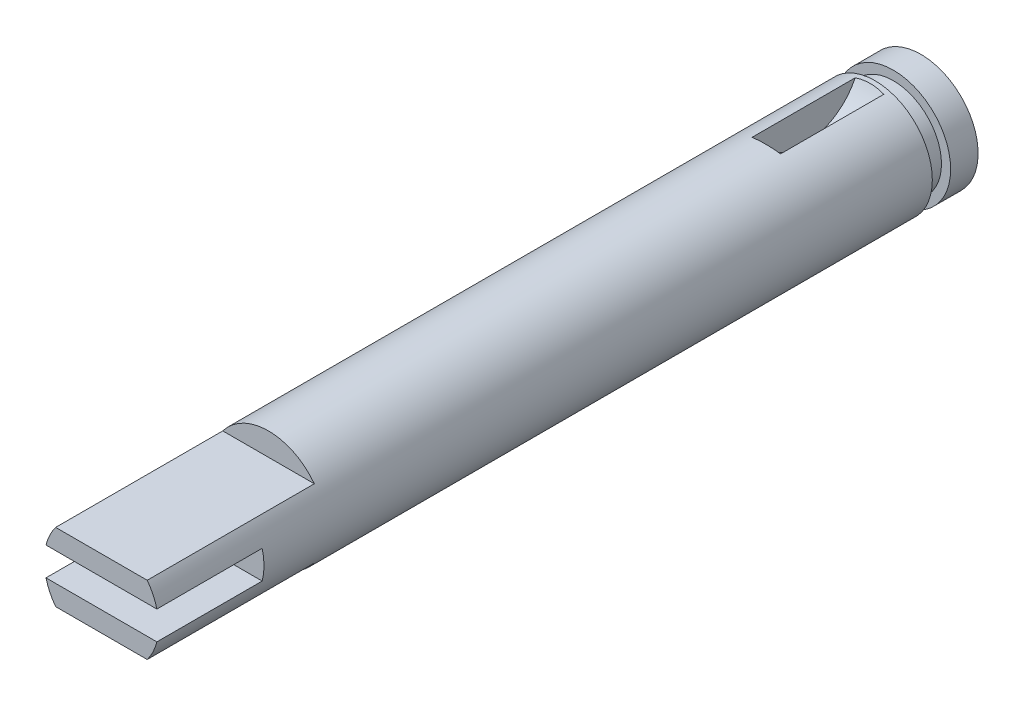
ISO-10303-21;
HEADER;
FILE_DESCRIPTION(('STEP AP214'),'2;1');
FILE_NAME('part.step','',(''),(''),'','','');
FILE_SCHEMA(('AUTOMOTIVE_DESIGN { 1 0 10303 214 1 1 1 1 }'));
ENDSEC;
DATA;
#1=APPLICATION_CONTEXT('core data for automotive mechanical design processes');
#2=APPLICATION_PROTOCOL_DEFINITION('international standard','automotive_design',2000,#1);
#3=PRODUCT_CONTEXT('',#1,'mechanical');
#4=PRODUCT('Part','Part','',(#3));
#5=PRODUCT_RELATED_PRODUCT_CATEGORY('part','',(#4));
#6=PRODUCT_DEFINITION_FORMATION('','',#4);
#7=PRODUCT_DEFINITION_CONTEXT('part definition',#1,'design');
#8=PRODUCT_DEFINITION('design','',#6,#7);
#9=PRODUCT_DEFINITION_SHAPE('','',#8);
#10=(LENGTH_UNIT() NAMED_UNIT(*) SI_UNIT(.MILLI.,.METRE.));
#11=(NAMED_UNIT(*) PLANE_ANGLE_UNIT() SI_UNIT($,.RADIAN.));
#12=(NAMED_UNIT(*) SI_UNIT($,.STERADIAN.) SOLID_ANGLE_UNIT());
#13=UNCERTAINTY_MEASURE_WITH_UNIT(LENGTH_MEASURE(1.E-05),#10,'distance_accuracy_value','');
#14=(GEOMETRIC_REPRESENTATION_CONTEXT(3) GLOBAL_UNCERTAINTY_ASSIGNED_CONTEXT((#13)) GLOBAL_UNIT_ASSIGNED_CONTEXT((#10,
#11,#12)) REPRESENTATION_CONTEXT('',''));
#15=CARTESIAN_POINT('',(0.,0.,0.));
#16=DIRECTION('',(0.,0.,1.));
#17=DIRECTION('',(1.,0.,0.));
#18=AXIS2_PLACEMENT_3D('',#15,#16,#17);
#19=CARTESIAN_POINT('',(0.,0.,42.926));
#20=DIRECTION('',(0.,0.,1.));
#21=DIRECTION('',(1.,0.,0.));
#22=AXIS2_PLACEMENT_3D('',#19,#20,#21);
#23=PLANE('',#22);
#24=CARTESIAN_POINT('',(0.,0.,42.926));
#25=DIRECTION('',(0.,0.,1.));
#26=DIRECTION('',(1.,0.,0.));
#27=AXIS2_PLACEMENT_3D('',#24,#25,#26);
#28=CIRCLE('',#27,3.175);
#29=CARTESIAN_POINT('',(-3.07581310225443,-0.7874,42.926));
#30=VERTEX_POINT('',#29);
#31=CARTESIAN_POINT('',(-2.54,-1.905,42.926));
#32=VERTEX_POINT('',#31);
#33=EDGE_CURVE('E198',#30,#32,#28,.T.);
#34=ORIENTED_EDGE('',*,*,#33,.T.);
#35=DIRECTION('',(1.,0.,0.));
#36=VECTOR('',#35,1.);
#37=CARTESIAN_POINT('',(-3.175,-1.905,42.926));
#38=LINE('',#37,#36);
#39=CARTESIAN_POINT('',(2.54,-1.905,42.926));
#40=VERTEX_POINT('',#39);
#41=EDGE_CURVE('E149',#32,#40,#38,.T.);
#42=ORIENTED_EDGE('',*,*,#41,.T.);
#43=CARTESIAN_POINT('',(3.07581310225443,-0.7874,42.926));
#44=VERTEX_POINT('',#43);
#45=EDGE_CURVE('E64',#40,#44,#28,.T.);
#46=ORIENTED_EDGE('',*,*,#45,.T.);
#47=DIRECTION('',(1.,0.,0.));
#48=VECTOR('',#47,1.);
#49=CARTESIAN_POINT('',(-3.175,-0.7874,42.926));
#50=LINE('',#49,#48);
#51=EDGE_CURVE('E161',#30,#44,#50,.T.);
#52=ORIENTED_EDGE('',*,*,#51,.F.);
#53=EDGE_LOOP('',(#34,#42,#46,#52));
#54=FACE_BOUND('',#53,.T.);
#55=ADVANCED_FACE('F39',(#54),#23,.T.);
#56=CARTESIAN_POINT('',(0.,0.,42.926));
#57=DIRECTION('',(0.,0.,-1.));
#58=DIRECTION('',(-1.,0.,0.));
#59=AXIS2_PLACEMENT_3D('',#56,#57,#58);
#60=CYLINDRICAL_SURFACE('',#59,3.175);
#61=CARTESIAN_POINT('',(0.,0.,0.));
#62=DIRECTION('',(0.,0.,1.));
#63=DIRECTION('',(1.,0.,0.));
#64=AXIS2_PLACEMENT_3D('',#61,#62,#63);
#65=CIRCLE('',#64,3.175);
#66=CARTESIAN_POINT('',(3.175,0.,0.));
#67=VERTEX_POINT('',#66);
#68=EDGE_CURVE('E183',#67,#67,#65,.T.);
#69=ORIENTED_EDGE('',*,*,#68,.T.);
#70=EDGE_LOOP('',(#69));
#71=FACE_BOUND('',#70,.T.);
#72=CARTESIAN_POINT('',(0.79375,3.07418053105214,0.31117755725787));
#73=CARTESIAN_POINT('',(0.714888608920865,3.09455662843597,0.301450554495417));
#74=CARTESIAN_POINT('',(0.63505416141262,3.11191895979803,0.293381371889491));
#75=CARTESIAN_POINT('',(0.474031104442736,3.14047497122854,0.280327929345211));
#76=CARTESIAN_POINT('',(0.392842353277951,3.15166800156809,0.275343994327388));
#77=CARTESIAN_POINT('',(0.231571379542788,3.16755748116306,0.268313017791284));
#78=CARTESIAN_POINT('',(0.151505888276026,3.17239566707134,0.266201862514545));
#79=CARTESIAN_POINT('',(-0.00875508518506204,3.17599957954489,0.264627640077035));
#80=CARTESIAN_POINT('',(-0.0889505252156203,3.17476698826052,0.265163839361458));
#81=CARTESIAN_POINT('',(-0.273819967836502,3.16491035844165,0.269480487372106));
#82=CARTESIAN_POINT('',(-0.378370536384788,3.1541121097031,0.274215701820489));
#83=CARTESIAN_POINT('',(-0.534502897532229,3.13013870504281,0.285045446695591));
#84=CARTESIAN_POINT('',(-0.586827990033408,3.12074930541512,0.289323834308464));
#85=CARTESIAN_POINT('',(-0.690818751526154,3.09938886056079,0.299223415951192));
#86=CARTESIAN_POINT('',(-0.742484433325476,3.08741786555765,0.304844583858243));
#87=CARTESIAN_POINT('',(-0.79375,3.07418053105214,0.31117755725787));
#88=B_SPLINE_CURVE_WITH_KNOTS('',3,(#72,#73,#74,#75,#76,#77,#78,#79,#80,#81,#82,#83,#84,#85,#86,
#87),.UNSPECIFIED.,.F.,.F.,(4,2,2,2,2,2,2,4),(0.,0.245998689057966,0.492023280877516,
0.732461803114019,0.972833706040775,1.28776854451322,1.44769609311939,1.60762053070593),.UNSPECIFIED.);
#89=CARTESIAN_POINT('',(0.79375,3.07418053105214,0.31117755725787));
#90=VERTEX_POINT('',#89);
#91=CARTESIAN_POINT('',(-0.79375,3.07418053105214,0.31117755725787));
#92=VERTEX_POINT('',#91);
#93=EDGE_CURVE('E213',#90,#92,#88,.T.);
#94=ORIENTED_EDGE('',*,*,#93,.F.);
#95=DIRECTION('',(0.,0.,-1.));
#96=VECTOR('',#95,1.);
#97=CARTESIAN_POINT('',(0.79375,3.07418053105214,42.926));
#98=LINE('',#97,#96);
#99=CARTESIAN_POINT('',(0.79375,3.07418053105214,6.03882244274213));
#100=VERTEX_POINT('',#99);
#101=EDGE_CURVE('E267',#90,#100,#98,.F.);
#102=ORIENTED_EDGE('',*,*,#101,.T.);
#103=CARTESIAN_POINT('',(-0.79375,3.07418053105214,6.03882244274213));
#104=CARTESIAN_POINT('',(-0.714888608920865,3.09455662843597,6.04854944550458));
#105=CARTESIAN_POINT('',(-0.63505416141262,3.11191895979803,6.05661862811051));
#106=CARTESIAN_POINT('',(-0.474031104442736,3.14047497122854,6.06967207065479));
#107=CARTESIAN_POINT('',(-0.392842353277951,3.15166800156809,6.07465600567261));
#108=CARTESIAN_POINT('',(-0.231571379542789,3.16755748116306,6.08168698220872));
#109=CARTESIAN_POINT('',(-0.151505888276026,3.17239566707134,6.08379813748545));
#110=CARTESIAN_POINT('',(0.0087550851850621,3.17599957954489,6.08537235992296));
#111=CARTESIAN_POINT('',(0.0889505252156204,3.17476698826052,6.08483616063854));
#112=CARTESIAN_POINT('',(0.273819967836502,3.16491035844165,6.08051951262789));
#113=CARTESIAN_POINT('',(0.378370536384788,3.1541121097031,6.07578429817951));
#114=CARTESIAN_POINT('',(0.534502897532229,3.13013870504281,6.06495455330441));
#115=CARTESIAN_POINT('',(0.586827990033408,3.12074930541512,6.06067616569154));
#116=CARTESIAN_POINT('',(0.690818751526154,3.09938886056079,6.05077658404881));
#117=CARTESIAN_POINT('',(0.742484433325476,3.08741786555765,6.04515541614176));
#118=CARTESIAN_POINT('',(0.79375,3.07418053105214,6.03882244274213));
#119=B_SPLINE_CURVE_WITH_KNOTS('',3,(#103,#104,#105,#106,#107,#108,#109,#110,#111,#112,#113,
#114,#115,#116,#117,#118),.UNSPECIFIED.,.F.,.F.,(4,2,2,2,2,2,2,4),(0.,0.245998689057966,
0.492023280877517,0.732461803114019,0.972833706040776,1.28776854451322,1.44769609311939,
1.60762053070593),.UNSPECIFIED.);
#120=CARTESIAN_POINT('',(-0.79375,3.07418053105214,6.03882244274213));
#121=VERTEX_POINT('',#120);
#122=EDGE_CURVE('E206',#121,#100,#119,.T.);
#123=ORIENTED_EDGE('',*,*,#122,.F.);
#124=DIRECTION('',(0.,0.,-1.));
#125=VECTOR('',#124,1.);
#126=CARTESIAN_POINT('',(-0.79375,3.07418053105214,42.926));
#127=LINE('',#126,#125);
#128=EDGE_CURVE('E203',#92,#121,#127,.F.);
#129=ORIENTED_EDGE('',*,*,#128,.F.);
#130=EDGE_LOOP('',(#94,#102,#123,#129));
#131=FACE_BOUND('',#130,.T.);
#132=DIRECTION('',(0.,0.,-1.));
#133=VECTOR('',#132,1.);
#134=CARTESIAN_POINT('',(-2.54,-1.905,42.926));
#135=LINE('',#134,#133);
#136=CARTESIAN_POINT('',(-2.54,-1.905,33.655));
#137=VERTEX_POINT('',#136);
#138=EDGE_CURVE('E12',#32,#137,#135,.T.);
#139=ORIENTED_EDGE('',*,*,#138,.F.);
#140=ORIENTED_EDGE('',*,*,#33,.F.);
#141=DIRECTION('',(0.,0.,-1.));
#142=VECTOR('',#141,1.);
#143=CARTESIAN_POINT('',(-3.07581310225443,-0.7874,42.926));
#144=LINE('',#143,#142);
#145=CARTESIAN_POINT('',(-3.07581310225443,-0.787399999999999,37.084));
#146=VERTEX_POINT('',#145);
#147=EDGE_CURVE('E263',#30,#146,#144,.T.);
#148=ORIENTED_EDGE('',*,*,#147,.T.);
#149=CARTESIAN_POINT('',(0.,0.,37.084));
#150=DIRECTION('',(0.,0.,-1.));
#151=DIRECTION('',(-1.,0.,0.));
#152=AXIS2_PLACEMENT_3D('',#149,#150,#151);
#153=CIRCLE('',#152,3.175);
#154=CARTESIAN_POINT('',(-3.07581310225443,0.787400000000001,37.084));
#155=VERTEX_POINT('',#154);
#156=EDGE_CURVE('E256',#146,#155,#153,.T.);
#157=ORIENTED_EDGE('',*,*,#156,.T.);
#158=DIRECTION('',(0.,0.,-1.));
#159=VECTOR('',#158,1.);
#160=CARTESIAN_POINT('',(-3.07581310225443,0.7874,42.926));
#161=LINE('',#160,#159);
#162=CARTESIAN_POINT('',(-3.07581310225443,0.7874,42.926));
#163=VERTEX_POINT('',#162);
#164=EDGE_CURVE('E249',#155,#163,#161,.F.);
#165=ORIENTED_EDGE('',*,*,#164,.T.);
#166=CARTESIAN_POINT('',(-2.54,1.905,42.926));
#167=VERTEX_POINT('',#166);
#168=EDGE_CURVE('E201',#167,#163,#28,.T.);
#169=ORIENTED_EDGE('',*,*,#168,.F.);
#170=DIRECTION('',(0.,0.,-1.));
#171=VECTOR('',#170,1.);
#172=CARTESIAN_POINT('',(-2.54,1.905,42.926));
#173=LINE('',#172,#171);
#174=CARTESIAN_POINT('',(-2.54,1.905,33.655));
#175=VERTEX_POINT('',#174);
#176=EDGE_CURVE('E144',#167,#175,#173,.T.);
#177=ORIENTED_EDGE('',*,*,#176,.T.);
#178=CARTESIAN_POINT('',(0.,0.,33.655));
#179=DIRECTION('',(0.,0.,-1.));
#180=DIRECTION('',(-1.,0.,0.));
#181=AXIS2_PLACEMENT_3D('',#178,#179,#180);
#182=CIRCLE('',#181,3.175);
#183=CARTESIAN_POINT('',(2.54,1.905,33.655));
#184=VERTEX_POINT('',#183);
#185=EDGE_CURVE('E270',#175,#184,#182,.T.);
#186=ORIENTED_EDGE('',*,*,#185,.T.);
#187=DIRECTION('',(0.,0.,-1.));
#188=VECTOR('',#187,1.);
#189=CARTESIAN_POINT('',(2.54,1.905,42.926));
#190=LINE('',#189,#188);
#191=CARTESIAN_POINT('',(2.54,1.905,42.926));
#192=VERTEX_POINT('',#191);
#193=EDGE_CURVE('E269',#184,#192,#190,.F.);
#194=ORIENTED_EDGE('',*,*,#193,.T.);
#195=CARTESIAN_POINT('',(3.07581310225443,0.7874,42.926));
#196=VERTEX_POINT('',#195);
#197=EDGE_CURVE('E202',#196,#192,#28,.T.);
#198=ORIENTED_EDGE('',*,*,#197,.F.);
#199=DIRECTION('',(0.,0.,-1.));
#200=VECTOR('',#199,1.);
#201=CARTESIAN_POINT('',(3.07581310225443,0.7874,42.926));
#202=LINE('',#201,#200);
#203=CARTESIAN_POINT('',(3.07581310225443,0.787400000000001,37.084));
#204=VERTEX_POINT('',#203);
#205=EDGE_CURVE('E260',#196,#204,#202,.T.);
#206=ORIENTED_EDGE('',*,*,#205,.T.);
#207=CARTESIAN_POINT('',(3.07581310225443,-0.787399999999999,37.084));
#208=VERTEX_POINT('',#207);
#209=EDGE_CURVE('E257',#204,#208,#153,.T.);
#210=ORIENTED_EDGE('',*,*,#209,.T.);
#211=DIRECTION('',(0.,0.,-1.));
#212=VECTOR('',#211,1.);
#213=CARTESIAN_POINT('',(3.07581310225443,-0.7874,42.926));
#214=LINE('',#213,#212);
#215=EDGE_CURVE('E253',#208,#44,#214,.F.);
#216=ORIENTED_EDGE('',*,*,#215,.T.);
#217=ORIENTED_EDGE('',*,*,#45,.F.);
#218=DIRECTION('',(0.,0.,-1.));
#219=VECTOR('',#218,1.);
#220=CARTESIAN_POINT('',(2.54,-1.905,42.926));
#221=LINE('',#220,#219);
#222=CARTESIAN_POINT('',(2.54,-1.905,33.655));
#223=VERTEX_POINT('',#222);
#224=EDGE_CURVE('E49',#223,#40,#221,.F.);
#225=ORIENTED_EDGE('',*,*,#224,.F.);
#226=CARTESIAN_POINT('',(0.,0.,33.655));
#227=DIRECTION('',(0.,0.,1.));
#228=DIRECTION('',(1.,0.,0.));
#229=AXIS2_PLACEMENT_3D('',#226,#227,#228);
#230=CIRCLE('',#229,3.175);
#231=EDGE_CURVE('E137',#137,#223,#230,.T.);
#232=ORIENTED_EDGE('',*,*,#231,.F.);
#233=EDGE_LOOP('',(#139,#140,#148,#157,#165,#169,#177,#186,#194,#198,#206,#210,#216,#217,#225,#232));
#234=FACE_BOUND('',#233,.T.);
#235=ADVANCED_FACE('F41',(#71,#131,#234),#60,.T.);
#236=DIRECTION('',(1.,0.,0.));
#237=VECTOR('',#236,1.);
#238=CARTESIAN_POINT('',(-3.175,1.905,42.926));
#239=LINE('',#238,#237);
#240=EDGE_CURVE('E56',#167,#192,#239,.T.);
#241=ORIENTED_EDGE('',*,*,#240,.F.);
#242=ORIENTED_EDGE('',*,*,#168,.T.);
#243=DIRECTION('',(1.,0.,0.));
#244=VECTOR('',#243,1.);
#245=CARTESIAN_POINT('',(-3.175,0.7874,42.926));
#246=LINE('',#245,#244);
#247=EDGE_CURVE('E164',#163,#196,#246,.T.);
#248=ORIENTED_EDGE('',*,*,#247,.T.);
#249=ORIENTED_EDGE('',*,*,#197,.T.);
#250=EDGE_LOOP('',(#241,#242,#248,#249));
#251=FACE_BOUND('',#250,.T.);
#252=ADVANCED_FACE('F228',(#251),#23,.T.);
#253=CARTESIAN_POINT('',(0.,0.,-2.54));
#254=DIRECTION('',(0.,0.,-1.));
#255=DIRECTION('',(-1.,0.,0.));
#256=AXIS2_PLACEMENT_3D('',#253,#254,#255);
#257=CIRCLE('',#256,3.175);
#258=CARTESIAN_POINT('',(-3.175,0.,-2.54));
#259=VERTEX_POINT('',#258);
#260=EDGE_CURVE('E187',#259,#259,#257,.T.);
#261=ORIENTED_EDGE('',*,*,#260,.F.);
#262=EDGE_LOOP('',(#261));
#263=FACE_BOUND('',#262,.T.);
#264=CARTESIAN_POINT('',(0.,0.,-1.016));
#265=DIRECTION('',(0.,0.,1.));
#266=DIRECTION('',(1.,0.,0.));
#267=AXIS2_PLACEMENT_3D('',#264,#265,#266);
#268=CIRCLE('',#267,3.175);
#269=CARTESIAN_POINT('',(3.175,0.,-1.016));
#270=VERTEX_POINT('',#269);
#271=EDGE_CURVE('E192',#270,#270,#268,.T.);
#272=ORIENTED_EDGE('',*,*,#271,.F.);
#273=EDGE_LOOP('',(#272));
#274=FACE_BOUND('',#273,.T.);
#275=ADVANCED_FACE('F233',(#263,#274),#60,.T.);
#276=CARTESIAN_POINT('',(0.,0.,-2.54));
#277=DIRECTION('',(0.,0.,-1.));
#278=DIRECTION('',(-1.,0.,0.));
#279=AXIS2_PLACEMENT_3D('',#276,#277,#278);
#280=PLANE('',#279);
#281=ORIENTED_EDGE('',*,*,#260,.T.);
#282=EDGE_LOOP('',(#281));
#283=FACE_BOUND('',#282,.T.);
#284=ADVANCED_FACE('F239',(#283),#280,.T.);
#285=CARTESIAN_POINT('',(0.,0.,-1.016));
#286=DIRECTION('',(0.,0.,1.));
#287=DIRECTION('',(1.,0.,0.));
#288=AXIS2_PLACEMENT_3D('',#285,#286,#287);
#289=PLANE('',#288);
#290=CARTESIAN_POINT('',(0.,0.,-1.016));
#291=DIRECTION('',(0.,0.,1.));
#292=DIRECTION('',(1.,0.,0.));
#293=AXIS2_PLACEMENT_3D('',#290,#291,#292);
#294=CIRCLE('',#293,2.667);
#295=CARTESIAN_POINT('',(2.667,0.,-1.016));
#296=VERTEX_POINT('',#295);
#297=EDGE_CURVE('E179',#296,#296,#294,.T.);
#298=ORIENTED_EDGE('',*,*,#297,.F.);
#299=EDGE_LOOP('',(#298));
#300=FACE_BOUND('',#299,.T.);
#301=ORIENTED_EDGE('',*,*,#271,.T.);
#302=EDGE_LOOP('',(#301));
#303=FACE_BOUND('',#302,.T.);
#304=ADVANCED_FACE('F313',(#300,#303),#289,.T.);
#305=CARTESIAN_POINT('',(0.,0.,0.));
#306=DIRECTION('',(0.,0.,1.));
#307=DIRECTION('',(1.,0.,0.));
#308=AXIS2_PLACEMENT_3D('',#305,#306,#307);
#309=PLANE('',#308);
#310=CARTESIAN_POINT('',(0.,0.,0.));
#311=DIRECTION('',(0.,0.,1.));
#312=DIRECTION('',(1.,0.,0.));
#313=AXIS2_PLACEMENT_3D('',#310,#311,#312);
#314=CIRCLE('',#313,2.667);
#315=CARTESIAN_POINT('',(2.667,0.,0.));
#316=VERTEX_POINT('',#315);
#317=EDGE_CURVE('E168',#316,#316,#314,.T.);
#318=ORIENTED_EDGE('',*,*,#317,.T.);
#319=EDGE_LOOP('',(#318));
#320=FACE_BOUND('',#319,.T.);
#321=ORIENTED_EDGE('',*,*,#68,.F.);
#322=EDGE_LOOP('',(#321));
#323=FACE_BOUND('',#322,.T.);
#324=ADVANCED_FACE('F307',(#320,#323),#309,.F.);
#325=CARTESIAN_POINT('',(0.,0.,-1.016));
#326=DIRECTION('',(0.,0.,1.));
#327=DIRECTION('',(1.,0.,0.));
#328=AXIS2_PLACEMENT_3D('',#325,#326,#327);
#329=CYLINDRICAL_SURFACE('',#328,2.667);
#330=ORIENTED_EDGE('',*,*,#297,.T.);
#331=EDGE_LOOP('',(#330));
#332=FACE_BOUND('',#331,.T.);
#333=ORIENTED_EDGE('',*,*,#317,.F.);
#334=EDGE_LOOP('',(#333));
#335=FACE_BOUND('',#334,.T.);
#336=ADVANCED_FACE('F302',(#332,#335),#329,.T.);
#337=CARTESIAN_POINT('',(-0.79375,4.445,3.175));
#338=DIRECTION('',(1.,0.,0.));
#339=DIRECTION('',(0.,0.,-1.));
#340=AXIS2_PLACEMENT_3D('',#337,#338,#339);
#341=PLANE('',#340);
#342=ORIENTED_EDGE('',*,*,#128,.T.);
#343=CARTESIAN_POINT('',(-0.79375,4.445,3.175));
#344=DIRECTION('',(1.,0.,0.));
#345=DIRECTION('',(0.,0.,-1.));
#346=AXIS2_PLACEMENT_3D('',#343,#344,#345);
#347=CIRCLE('',#346,3.175);
#348=EDGE_CURVE('E191',#121,#92,#347,.T.);
#349=ORIENTED_EDGE('',*,*,#348,.T.);
#350=EDGE_LOOP('',(#342,#349));
#351=FACE_BOUND('',#350,.T.);
#352=ADVANCED_FACE('F300',(#351),#341,.T.);
#353=CARTESIAN_POINT('',(0.79375,4.445,3.175));
#354=DIRECTION('',(1.,0.,0.));
#355=DIRECTION('',(0.,0.,-1.));
#356=AXIS2_PLACEMENT_3D('',#353,#354,#355);
#357=PLANE('',#356);
#358=CARTESIAN_POINT('',(0.79375,4.445,3.175));
#359=DIRECTION('',(1.,0.,0.));
#360=DIRECTION('',(0.,0.,-1.));
#361=AXIS2_PLACEMENT_3D('',#358,#359,#360);
#362=CIRCLE('',#361,3.175);
#363=EDGE_CURVE('E194',#100,#90,#362,.T.);
#364=ORIENTED_EDGE('',*,*,#363,.F.);
#365=ORIENTED_EDGE('',*,*,#101,.F.);
#366=EDGE_LOOP('',(#364,#365));
#367=FACE_BOUND('',#366,.T.);
#368=ADVANCED_FACE('F223',(#367),#357,.F.);
#369=CARTESIAN_POINT('',(0.79375,4.445,3.175));
#370=DIRECTION('',(-1.,0.,0.));
#371=DIRECTION('',(0.,0.,1.));
#372=AXIS2_PLACEMENT_3D('',#369,#370,#371);
#373=CYLINDRICAL_SURFACE('',#372,3.175);
#374=ORIENTED_EDGE('',*,*,#93,.T.);
#375=ORIENTED_EDGE('',*,*,#348,.F.);
#376=ORIENTED_EDGE('',*,*,#122,.T.);
#377=ORIENTED_EDGE('',*,*,#363,.T.);
#378=EDGE_LOOP('',(#374,#375,#376,#377));
#379=FACE_BOUND('',#378,.T.);
#380=ADVANCED_FACE('F218',(#379),#373,.F.);
#381=CARTESIAN_POINT('',(-3.175,0.787400000000001,37.084));
#382=DIRECTION('',(0.,1.,0.));
#383=DIRECTION('',(0.,0.,1.));
#384=AXIS2_PLACEMENT_3D('',#381,#382,#383);
#385=PLANE('',#384);
#386=ORIENTED_EDGE('',*,*,#247,.F.);
#387=ORIENTED_EDGE('',*,*,#164,.F.);
#388=DIRECTION('',(1.,0.,0.));
#389=VECTOR('',#388,1.);
#390=CARTESIAN_POINT('',(-3.175,0.787400000000001,37.084));
#391=LINE('',#390,#389);
#392=EDGE_CURVE('E169',#155,#204,#391,.T.);
#393=ORIENTED_EDGE('',*,*,#392,.T.);
#394=ORIENTED_EDGE('',*,*,#205,.F.);
#395=EDGE_LOOP('',(#386,#387,#393,#394));
#396=FACE_BOUND('',#395,.T.);
#397=ADVANCED_FACE('F222',(#396),#385,.F.);
#398=CARTESIAN_POINT('',(-3.175,0.,37.084));
#399=DIRECTION('',(0.,0.,-1.));
#400=DIRECTION('',(-1.,0.,0.));
#401=AXIS2_PLACEMENT_3D('',#398,#399,#400);
#402=PLANE('',#401);
#403=ORIENTED_EDGE('',*,*,#392,.F.);
#404=ORIENTED_EDGE('',*,*,#156,.F.);
#405=DIRECTION('',(1.,0.,0.));
#406=VECTOR('',#405,1.);
#407=CARTESIAN_POINT('',(-3.175,-0.787399999999999,37.084));
#408=LINE('',#407,#406);
#409=EDGE_CURVE('E173',#146,#208,#408,.T.);
#410=ORIENTED_EDGE('',*,*,#409,.T.);
#411=ORIENTED_EDGE('',*,*,#209,.F.);
#412=EDGE_LOOP('',(#403,#404,#410,#411));
#413=FACE_BOUND('',#412,.T.);
#414=ADVANCED_FACE('F325',(#413),#402,.F.);
#415=CARTESIAN_POINT('',(-3.175,-0.787399999999999,37.084));
#416=DIRECTION('',(0.,-1.,0.));
#417=DIRECTION('',(0.,0.,-1.));
#418=AXIS2_PLACEMENT_3D('',#415,#416,#417);
#419=PLANE('',#418);
#420=ORIENTED_EDGE('',*,*,#51,.T.);
#421=ORIENTED_EDGE('',*,*,#215,.F.);
#422=ORIENTED_EDGE('',*,*,#409,.F.);
#423=ORIENTED_EDGE('',*,*,#147,.F.);
#424=EDGE_LOOP('',(#420,#421,#422,#423));
#425=FACE_BOUND('',#424,.T.);
#426=ADVANCED_FACE('F321',(#425),#419,.F.);
#427=CARTESIAN_POINT('',(-3.175,1.905,33.655));
#428=DIRECTION('',(0.,0.,-1.));
#429=DIRECTION('',(-1.,0.,0.));
#430=AXIS2_PLACEMENT_3D('',#427,#428,#429);
#431=PLANE('',#430);
#432=DIRECTION('',(1.,0.,0.));
#433=VECTOR('',#432,1.);
#434=CARTESIAN_POINT('',(-3.175,1.905,33.655));
#435=LINE('',#434,#433);
#436=EDGE_CURVE('E157',#175,#184,#435,.T.);
#437=ORIENTED_EDGE('',*,*,#436,.T.);
#438=ORIENTED_EDGE('',*,*,#185,.F.);
#439=EDGE_LOOP('',(#437,#438));
#440=FACE_BOUND('',#439,.T.);
#441=ADVANCED_FACE('F324',(#440),#431,.F.);
#442=CARTESIAN_POINT('',(-3.175,1.905,40.005));
#443=DIRECTION('',(0.,-1.,0.));
#444=DIRECTION('',(0.,0.,-1.));
#445=AXIS2_PLACEMENT_3D('',#442,#443,#444);
#446=PLANE('',#445);
#447=ORIENTED_EDGE('',*,*,#240,.T.);
#448=ORIENTED_EDGE('',*,*,#193,.F.);
#449=ORIENTED_EDGE('',*,*,#436,.F.);
#450=ORIENTED_EDGE('',*,*,#176,.F.);
#451=EDGE_LOOP('',(#447,#448,#449,#450));
#452=FACE_BOUND('',#451,.T.);
#453=ADVANCED_FACE('F333',(#452),#446,.F.);
#454=CARTESIAN_POINT('',(-3.175,-1.905,42.926));
#455=DIRECTION('',(0.,-1.,0.));
#456=DIRECTION('',(0.,0.,-1.));
#457=AXIS2_PLACEMENT_3D('',#454,#455,#456);
#458=PLANE('',#457);
#459=ORIENTED_EDGE('',*,*,#138,.T.);
#460=DIRECTION('',(1.,0.,0.));
#461=VECTOR('',#460,1.);
#462=CARTESIAN_POINT('',(-3.175,-1.905,33.655));
#463=LINE('',#462,#461);
#464=EDGE_CURVE('E148',#137,#223,#463,.T.);
#465=ORIENTED_EDGE('',*,*,#464,.T.);
#466=ORIENTED_EDGE('',*,*,#224,.T.);
#467=ORIENTED_EDGE('',*,*,#41,.F.);
#468=EDGE_LOOP('',(#459,#465,#466,#467));
#469=FACE_BOUND('',#468,.T.);
#470=ADVANCED_FACE('F147',(#469),#458,.T.);
#471=CARTESIAN_POINT('',(-3.175,-1.905,33.655));
#472=DIRECTION('',(0.,0.,1.));
#473=DIRECTION('',(1.,0.,0.));
#474=AXIS2_PLACEMENT_3D('',#471,#472,#473);
#475=PLANE('',#474);
#476=ORIENTED_EDGE('',*,*,#464,.F.);
#477=ORIENTED_EDGE('',*,*,#231,.T.);
#478=EDGE_LOOP('',(#476,#477));
#479=FACE_BOUND('',#478,.T.);
#480=ADVANCED_FACE('F150',(#479),#475,.T.);
#481=CLOSED_SHELL('',(#55,#235,#252,#275,#284,#304,#324,#336,#352,#368,#380,#397,#414,#426,#441,
#453,#470,#480));
#482=MANIFOLD_SOLID_BREP('B2',#481);
#483=ADVANCED_BREP_SHAPE_REPRESENTATION('',(#18,#482),#14);
#484=SHAPE_DEFINITION_REPRESENTATION(#9,#483);
ENDSEC;
END-ISO-10303-21;
